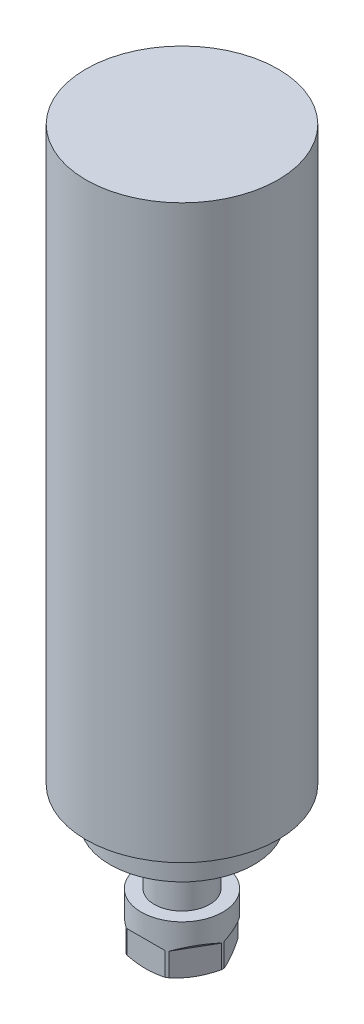
ISO-10303-21;
HEADER;
FILE_DESCRIPTION(('STEP AP214'),'2;1');
FILE_NAME('part.step','',(''),(''),'','','');
FILE_SCHEMA(('AUTOMOTIVE_DESIGN { 1 0 10303 214 1 1 1 1 }'));
ENDSEC;
DATA;
#1=APPLICATION_CONTEXT('core data for automotive mechanical design processes');
#2=APPLICATION_PROTOCOL_DEFINITION('international standard','automotive_design',2000,#1);
#3=PRODUCT_CONTEXT('',#1,'mechanical');
#4=PRODUCT('Part','Part','',(#3));
#5=PRODUCT_RELATED_PRODUCT_CATEGORY('part','',(#4));
#6=PRODUCT_DEFINITION_FORMATION('','',#4);
#7=PRODUCT_DEFINITION_CONTEXT('part definition',#1,'design');
#8=PRODUCT_DEFINITION('design','',#6,#7);
#9=PRODUCT_DEFINITION_SHAPE('','',#8);
#10=(LENGTH_UNIT() NAMED_UNIT(*) SI_UNIT(.MILLI.,.METRE.));
#11=(NAMED_UNIT(*) PLANE_ANGLE_UNIT() SI_UNIT($,.RADIAN.));
#12=(NAMED_UNIT(*) SI_UNIT($,.STERADIAN.) SOLID_ANGLE_UNIT());
#13=UNCERTAINTY_MEASURE_WITH_UNIT(LENGTH_MEASURE(1.E-05),#10,'distance_accuracy_value','');
#14=(GEOMETRIC_REPRESENTATION_CONTEXT(3) GLOBAL_UNCERTAINTY_ASSIGNED_CONTEXT((#13)) GLOBAL_UNIT_ASSIGNED_CONTEXT((#10,
#11,#12)) REPRESENTATION_CONTEXT('',''));
#15=CARTESIAN_POINT('',(0.,0.,0.));
#16=DIRECTION('',(0.,0.,1.));
#17=DIRECTION('',(1.,0.,0.));
#18=AXIS2_PLACEMENT_3D('',#15,#16,#17);
#19=CARTESIAN_POINT('',(0.,-109.7,39.9));
#20=DIRECTION('',(0.,-1.,0.));
#21=DIRECTION('',(0.,0.,-1.));
#22=AXIS2_PLACEMENT_3D('',#19,#20,#21);
#23=PLANE('',#22);
#24=CARTESIAN_POINT('',(0.,-109.7,0.));
#25=DIRECTION('',(0.,1.,0.));
#26=DIRECTION('',(0.,0.,1.));
#27=AXIS2_PLACEMENT_3D('',#24,#25,#26);
#28=CIRCLE('',#27,30.);
#29=CARTESIAN_POINT('',(0.,-109.7,30.));
#30=VERTEX_POINT('',#29);
#31=EDGE_CURVE('E202',#30,#30,#28,.T.);
#32=ORIENTED_EDGE('',*,*,#31,.T.);
#33=EDGE_LOOP('',(#32));
#34=FACE_BOUND('',#33,.T.);
#35=CARTESIAN_POINT('',(0.,-109.7,0.));
#36=DIRECTION('',(0.,-1.,0.));
#37=DIRECTION('',(0.,0.,-1.));
#38=AXIS2_PLACEMENT_3D('',#35,#36,#37);
#39=CIRCLE('',#38,40.);
#40=CARTESIAN_POINT('',(0.,-109.7,-40.0000000000001));
#41=VERTEX_POINT('',#40);
#42=EDGE_CURVE('E294',#41,#41,#39,.F.);
#43=ORIENTED_EDGE('',*,*,#42,.F.);
#44=EDGE_LOOP('',(#43));
#45=FACE_BOUND('',#44,.T.);
#46=ADVANCED_FACE('F41',(#34,#45),#23,.T.);
#47=CARTESIAN_POINT('',(0.,128.3,0.));
#48=DIRECTION('',(0.,1.,0.));
#49=DIRECTION('',(0.,0.,1.));
#50=AXIS2_PLACEMENT_3D('',#47,#48,#49);
#51=CYLINDRICAL_SURFACE('',#50,30.);
#52=CARTESIAN_POINT('',(0.,-123.7,0.));
#53=DIRECTION('',(0.,1.,0.));
#54=DIRECTION('',(0.,0.,1.));
#55=AXIS2_PLACEMENT_3D('',#52,#53,#54);
#56=CIRCLE('',#55,30.);
#57=CARTESIAN_POINT('',(0.,-123.7,30.));
#58=VERTEX_POINT('',#57);
#59=EDGE_CURVE('E199',#58,#58,#56,.T.);
#60=ORIENTED_EDGE('',*,*,#59,.T.);
#61=EDGE_LOOP('',(#60));
#62=FACE_BOUND('',#61,.T.);
#63=ORIENTED_EDGE('',*,*,#31,.F.);
#64=EDGE_LOOP('',(#63));
#65=FACE_BOUND('',#64,.T.);
#66=ADVANCED_FACE('F262',(#62,#65),#51,.T.);
#67=CARTESIAN_POINT('',(0.,-123.7,30.));
#68=DIRECTION('',(0.,-1.,0.));
#69=DIRECTION('',(0.,0.,-1.));
#70=AXIS2_PLACEMENT_3D('',#67,#68,#69);
#71=PLANE('',#70);
#72=CARTESIAN_POINT('',(0.,-123.7,0.));
#73=DIRECTION('',(0.,1.,0.));
#74=DIRECTION('',(0.,0.,1.));
#75=AXIS2_PLACEMENT_3D('',#72,#73,#74);
#76=CIRCLE('',#75,24.1);
#77=CARTESIAN_POINT('',(0.,-123.7,24.1));
#78=VERTEX_POINT('',#77);
#79=EDGE_CURVE('E194',#78,#78,#76,.T.);
#80=ORIENTED_EDGE('',*,*,#79,.T.);
#81=EDGE_LOOP('',(#80));
#82=FACE_BOUND('',#81,.T.);
#83=ORIENTED_EDGE('',*,*,#59,.F.);
#84=EDGE_LOOP('',(#83));
#85=FACE_BOUND('',#84,.T.);
#86=ADVANCED_FACE('F258',(#82,#85),#71,.T.);
#87=CARTESIAN_POINT('',(0.,128.3,0.));
#88=DIRECTION('',(0.,1.,0.));
#89=DIRECTION('',(0.,0.,1.));
#90=AXIS2_PLACEMENT_3D('',#87,#88,#89);
#91=CYLINDRICAL_SURFACE('',#90,24.1);
#92=CARTESIAN_POINT('',(0.,-126.8,0.));
#93=DIRECTION('',(0.,-1.,0.));
#94=DIRECTION('',(0.,0.,-1.));
#95=AXIS2_PLACEMENT_3D('',#92,#93,#94);
#96=CIRCLE('',#95,24.1);
#97=CARTESIAN_POINT('',(0.,-126.8,-24.1));
#98=VERTEX_POINT('',#97);
#99=EDGE_CURVE('E205',#98,#98,#96,.F.);
#100=ORIENTED_EDGE('',*,*,#99,.T.);
#101=EDGE_LOOP('',(#100));
#102=FACE_BOUND('',#101,.T.);
#103=ORIENTED_EDGE('',*,*,#79,.F.);
#104=EDGE_LOOP('',(#103));
#105=FACE_BOUND('',#104,.T.);
#106=ADVANCED_FACE('F254',(#102,#105),#91,.T.);
#107=CARTESIAN_POINT('',(0.,-128.3,24.1));
#108=DIRECTION('',(0.,-1.,0.));
#109=DIRECTION('',(0.,0.,-1.));
#110=AXIS2_PLACEMENT_3D('',#107,#108,#109);
#111=PLANE('',#110);
#112=CARTESIAN_POINT('',(0.,-128.3,0.));
#113=DIRECTION('',(0.,-1.,0.));
#114=DIRECTION('',(0.,0.,-1.));
#115=AXIS2_PLACEMENT_3D('',#112,#113,#114);
#116=CIRCLE('',#115,11.5);
#117=CARTESIAN_POINT('',(0.,-128.3,-11.5));
#118=VERTEX_POINT('',#117);
#119=EDGE_CURVE('E190',#118,#118,#116,.T.);
#120=ORIENTED_EDGE('',*,*,#119,.F.);
#121=EDGE_LOOP('',(#120));
#122=FACE_BOUND('',#121,.T.);
#123=CARTESIAN_POINT('',(0.,-128.3,0.));
#124=DIRECTION('',(0.,-1.,0.));
#125=DIRECTION('',(0.,0.,-1.));
#126=AXIS2_PLACEMENT_3D('',#123,#124,#125);
#127=CIRCLE('',#126,17.0999999999997);
#128=CARTESIAN_POINT('',(0.,-128.3,-17.0999999999998));
#129=VERTEX_POINT('',#128);
#130=EDGE_CURVE('E208',#129,#129,#127,.T.);
#131=ORIENTED_EDGE('',*,*,#130,.T.);
#132=EDGE_LOOP('',(#131));
#133=FACE_BOUND('',#132,.T.);
#134=ADVANCED_FACE('F251',(#122,#133),#111,.T.);
#135=CARTESIAN_POINT('',(0.,-126.8,0.));
#136=DIRECTION('',(0.,1.,0.));
#137=DIRECTION('',(0.,0.,1.));
#138=AXIS2_PLACEMENT_3D('',#135,#136,#137);
#139=CONICAL_SURFACE('',#138,24.1,1.35970299357215);
#140=ORIENTED_EDGE('',*,*,#130,.F.);
#141=EDGE_LOOP('',(#140));
#142=FACE_BOUND('',#141,.T.);
#143=ORIENTED_EDGE('',*,*,#99,.F.);
#144=EDGE_LOOP('',(#143));
#145=FACE_BOUND('',#144,.T.);
#146=ADVANCED_FACE('F249',(#142,#145),#139,.T.);
#147=CARTESIAN_POINT('',(0.,-147.3,0.));
#148=DIRECTION('',(0.,1.,0.));
#149=DIRECTION('',(0.,0.,1.));
#150=AXIS2_PLACEMENT_3D('',#147,#148,#149);
#151=CYLINDRICAL_SURFACE('',#150,11.5);
#152=CARTESIAN_POINT('',(0.,-147.3,0.));
#153=DIRECTION('',(0.,-1.,0.));
#154=DIRECTION('',(0.,0.,-1.));
#155=AXIS2_PLACEMENT_3D('',#152,#153,#154);
#156=CIRCLE('',#155,11.5);
#157=CARTESIAN_POINT('',(0.,-147.3,-11.5));
#158=VERTEX_POINT('',#157);
#159=EDGE_CURVE('E191',#158,#158,#156,.T.);
#160=ORIENTED_EDGE('',*,*,#159,.F.);
#161=EDGE_LOOP('',(#160));
#162=FACE_BOUND('',#161,.T.);
#163=ORIENTED_EDGE('',*,*,#119,.T.);
#164=EDGE_LOOP('',(#163));
#165=FACE_BOUND('',#164,.T.);
#166=ADVANCED_FACE('F246',(#162,#165),#151,.T.);
#167=CARTESIAN_POINT('',(0.,-169.8,0.));
#168=DIRECTION('',(0.,1.,0.));
#169=DIRECTION('',(0.,0.,1.));
#170=AXIS2_PLACEMENT_3D('',#167,#168,#169);
#171=CYLINDRICAL_SURFACE('',#170,17.);
#172=CARTESIAN_POINT('',(0.,-167.8,0.));
#173=DIRECTION('',(0.,-1.,0.));
#174=DIRECTION('',(0.,0.,-1.));
#175=AXIS2_PLACEMENT_3D('',#172,#173,#174);
#176=CIRCLE('',#175,17.);
#177=CARTESIAN_POINT('',(-16.9903810567666,-167.8,-0.571796769724566));
#178=VERTEX_POINT('',#177);
#179=CARTESIAN_POINT('',(-16.9903810567666,-167.8,0.571796769724456));
#180=VERTEX_POINT('',#179);
#181=EDGE_CURVE('E312',#178,#180,#176,.F.);
#182=ORIENTED_EDGE('',*,*,#181,.T.);
#183=DIRECTION('',(0.,1.,0.));
#184=VECTOR('',#183,1.);
#185=CARTESIAN_POINT('',(-16.9903810567666,-169.8,0.571796769724445));
#186=LINE('',#185,#184);
#187=CARTESIAN_POINT('',(-16.9903810567666,-158.2,0.571796769724423));
#188=VERTEX_POINT('',#187);
#189=EDGE_CURVE('E57',#180,#188,#186,.T.);
#190=ORIENTED_EDGE('',*,*,#189,.T.);
#191=CARTESIAN_POINT('',(0.,-173.2,0.));
#192=DIRECTION('',(0.612372435695794,0.707106781186548,-0.353553390593272));
#193=DIRECTION('',(-0.612372435695796,0.707106781186547,0.353553390593273));
#194=AXIS2_PLACEMENT_3D('',#191,#192,#193);
#195=ELLIPSE('',#194,24.0416305603426,17.);
#196=CARTESIAN_POINT('',(-8.99038105676662,-158.2,14.4282032302755));
#197=VERTEX_POINT('',#196);
#198=EDGE_CURVE('E12',#188,#197,#195,.T.);
#199=ORIENTED_EDGE('',*,*,#198,.T.);
#200=DIRECTION('',(0.,1.,0.));
#201=VECTOR('',#200,1.);
#202=CARTESIAN_POINT('',(-8.9903810567666,-169.8,14.4282032302755));
#203=LINE('',#202,#201);
#204=CARTESIAN_POINT('',(-8.99038105676662,-167.8,14.4282032302755));
#205=VERTEX_POINT('',#204);
#206=EDGE_CURVE('E174',#197,#205,#203,.F.);
#207=ORIENTED_EDGE('',*,*,#206,.T.);
#208=CARTESIAN_POINT('',(-8.00000000000001,-167.8,15.));
#209=VERTEX_POINT('',#208);
#210=EDGE_CURVE('E214',#205,#209,#176,.F.);
#211=ORIENTED_EDGE('',*,*,#210,.T.);
#212=DIRECTION('',(0.,1.,0.));
#213=VECTOR('',#212,1.);
#214=CARTESIAN_POINT('',(-8.,-169.8,15.));
#215=LINE('',#214,#213);
#216=CARTESIAN_POINT('',(-8.00000000000001,-158.2,15.));
#217=VERTEX_POINT('',#216);
#218=EDGE_CURVE('E184',#209,#217,#215,.T.);
#219=ORIENTED_EDGE('',*,*,#218,.T.);
#220=CARTESIAN_POINT('',(0.,-173.2,0.));
#221=DIRECTION('',(0.,0.707106781186548,-0.707106781186547));
#222=DIRECTION('',(0.,0.707106781186547,0.707106781186548));
#223=AXIS2_PLACEMENT_3D('',#220,#221,#222);
#224=ELLIPSE('',#223,24.0416305603426,17.);
#225=CARTESIAN_POINT('',(8.00000000000001,-158.2,15.));
#226=VERTEX_POINT('',#225);
#227=EDGE_CURVE('E226',#217,#226,#224,.T.);
#228=ORIENTED_EDGE('',*,*,#227,.T.);
#229=DIRECTION('',(0.,1.,0.));
#230=VECTOR('',#229,1.);
#231=CARTESIAN_POINT('',(8.,-169.8,15.));
#232=LINE('',#231,#230);
#233=CARTESIAN_POINT('',(8.00000000000001,-167.8,15.));
#234=VERTEX_POINT('',#233);
#235=EDGE_CURVE('E181',#226,#234,#232,.F.);
#236=ORIENTED_EDGE('',*,*,#235,.T.);
#237=CARTESIAN_POINT('',(8.99038105676641,-167.8,14.4282032302756));
#238=VERTEX_POINT('',#237);
#239=EDGE_CURVE('E215',#234,#238,#176,.F.);
#240=ORIENTED_EDGE('',*,*,#239,.T.);
#241=DIRECTION('',(0.,1.,0.));
#242=VECTOR('',#241,1.);
#243=CARTESIAN_POINT('',(8.99038105676641,-169.8,14.4282032302756));
#244=LINE('',#243,#242);
#245=CARTESIAN_POINT('',(8.99038105676641,-158.2,14.4282032302756));
#246=VERTEX_POINT('',#245);
#247=EDGE_CURVE('E165',#238,#246,#244,.T.);
#248=ORIENTED_EDGE('',*,*,#247,.T.);
#249=CARTESIAN_POINT('',(0.,-173.2,0.));
#250=DIRECTION('',(-0.61237243569579,0.707106781186548,-0.35355339059328));
#251=DIRECTION('',(0.612372435695791,0.707106781186547,0.353553390593281));
#252=AXIS2_PLACEMENT_3D('',#249,#250,#251);
#253=ELLIPSE('',#252,24.0416305603426,17.);
#254=CARTESIAN_POINT('',(16.9903810567666,-158.2,0.571796769724693));
#255=VERTEX_POINT('',#254);
#256=EDGE_CURVE('E363',#246,#255,#253,.T.);
#257=ORIENTED_EDGE('',*,*,#256,.T.);
#258=DIRECTION('',(0.,1.,0.));
#259=VECTOR('',#258,1.);
#260=CARTESIAN_POINT('',(16.9903810567666,-169.8,0.57179676972469));
#261=LINE('',#260,#259);
#262=CARTESIAN_POINT('',(16.9903810567666,-167.8,0.57179676972469));
#263=VERTEX_POINT('',#262);
#264=EDGE_CURVE('E162',#255,#263,#261,.F.);
#265=ORIENTED_EDGE('',*,*,#264,.T.);
#266=CARTESIAN_POINT('',(16.9903810567666,-167.8,-0.571796769724331));
#267=VERTEX_POINT('',#266);
#268=EDGE_CURVE('E219',#263,#267,#176,.F.);
#269=ORIENTED_EDGE('',*,*,#268,.T.);
#270=DIRECTION('',(0.,1.,0.));
#271=VECTOR('',#270,1.);
#272=CARTESIAN_POINT('',(16.9903810567666,-169.8,-0.571796769724332));
#273=LINE('',#272,#271);
#274=CARTESIAN_POINT('',(16.9903810567666,-158.2,-0.571796769724325));
#275=VERTEX_POINT('',#274);
#276=EDGE_CURVE('E171',#267,#275,#273,.T.);
#277=ORIENTED_EDGE('',*,*,#276,.T.);
#278=CARTESIAN_POINT('',(0.,-173.2,0.));
#279=DIRECTION('',(-0.612372435695797,0.707106781186548,0.353553390593268));
#280=DIRECTION('',(0.612372435695799,0.707106781186547,-0.353553390593269));
#281=AXIS2_PLACEMENT_3D('',#278,#279,#280);
#282=ELLIPSE('',#281,24.0416305603426,17.);
#283=CARTESIAN_POINT('',(8.99038105676672,-158.2,-14.4282032302754));
#284=VERTEX_POINT('',#283);
#285=EDGE_CURVE('E50',#275,#284,#282,.T.);
#286=ORIENTED_EDGE('',*,*,#285,.T.);
#287=DIRECTION('',(0.,1.,0.));
#288=VECTOR('',#287,1.);
#289=CARTESIAN_POINT('',(8.99038105676671,-169.8,-14.4282032302754));
#290=LINE('',#289,#288);
#291=CARTESIAN_POINT('',(8.99038105676671,-167.8,-14.4282032302754));
#292=VERTEX_POINT('',#291);
#293=EDGE_CURVE('E168',#284,#292,#290,.F.);
#294=ORIENTED_EDGE('',*,*,#293,.T.);
#295=CARTESIAN_POINT('',(8.00000000000001,-167.8,-15.));
#296=VERTEX_POINT('',#295);
#297=EDGE_CURVE('E314',#292,#296,#176,.F.);
#298=ORIENTED_EDGE('',*,*,#297,.T.);
#299=DIRECTION('',(0.,1.,0.));
#300=VECTOR('',#299,1.);
#301=CARTESIAN_POINT('',(8.,-169.8,-15.));
#302=LINE('',#301,#300);
#303=CARTESIAN_POINT('',(8.00000000000001,-158.2,-15.));
#304=VERTEX_POINT('',#303);
#305=EDGE_CURVE('E155',#296,#304,#302,.T.);
#306=ORIENTED_EDGE('',*,*,#305,.T.);
#307=CARTESIAN_POINT('',(0.,-173.2,0.));
#308=DIRECTION('',(0.,0.707106781186548,0.707106781186547));
#309=DIRECTION('',(0.,0.707106781186547,-0.707106781186548));
#310=AXIS2_PLACEMENT_3D('',#307,#308,#309);
#311=ELLIPSE('',#310,24.0416305603426,17.);
#312=CARTESIAN_POINT('',(-8.00000000000001,-158.2,-15.));
#313=VERTEX_POINT('',#312);
#314=EDGE_CURVE('E138',#304,#313,#311,.T.);
#315=ORIENTED_EDGE('',*,*,#314,.T.);
#316=DIRECTION('',(0.,1.,0.));
#317=VECTOR('',#316,1.);
#318=CARTESIAN_POINT('',(-8.,-169.8,-15.));
#319=LINE('',#318,#317);
#320=CARTESIAN_POINT('',(-8.00000000000019,-167.8,-15.));
#321=VERTEX_POINT('',#320);
#322=EDGE_CURVE('E153',#313,#321,#319,.F.);
#323=ORIENTED_EDGE('',*,*,#322,.T.);
#324=CARTESIAN_POINT('',(-8.99038105676651,-167.8,-14.4282032302756));
#325=VERTEX_POINT('',#324);
#326=EDGE_CURVE('E152',#321,#325,#176,.F.);
#327=ORIENTED_EDGE('',*,*,#326,.T.);
#328=DIRECTION('',(0.,1.,0.));
#329=VECTOR('',#328,1.);
#330=CARTESIAN_POINT('',(-8.99038105676651,-169.8,-14.4282032302756));
#331=LINE('',#330,#329);
#332=CARTESIAN_POINT('',(-8.9903810567665,-158.2,-14.4282032302756));
#333=VERTEX_POINT('',#332);
#334=EDGE_CURVE('E65',#325,#333,#331,.T.);
#335=ORIENTED_EDGE('',*,*,#334,.T.);
#336=CARTESIAN_POINT('',(0.,-173.2,0.));
#337=DIRECTION('',(0.612372435695792,0.707106781186549,0.353553390593276));
#338=DIRECTION('',(-0.612372435695794,0.707106781186547,-0.353553390593277));
#339=AXIS2_PLACEMENT_3D('',#336,#337,#338);
#340=ELLIPSE('',#339,24.0416305603426,17.);
#341=CARTESIAN_POINT('',(-16.9903810567666,-158.2,-0.571796769724596));
#342=VERTEX_POINT('',#341);
#343=EDGE_CURVE('E133',#333,#342,#340,.T.);
#344=ORIENTED_EDGE('',*,*,#343,.T.);
#345=DIRECTION('',(0.,1.,0.));
#346=VECTOR('',#345,1.);
#347=CARTESIAN_POINT('',(-16.9903810567666,-169.8,-0.571796769724562));
#348=LINE('',#347,#346);
#349=EDGE_CURVE('E142',#342,#178,#348,.F.);
#350=ORIENTED_EDGE('',*,*,#349,.T.);
#351=EDGE_LOOP('',(#182,#190,#199,#207,#211,#219,#228,#236,#240,#248,#257,#265,#269,#277,#286,
#294,#298,#306,#315,#323,#327,#335,#344,#350));
#352=FACE_BOUND('',#351,.T.);
#353=CARTESIAN_POINT('',(0.,-147.3,0.));
#354=DIRECTION('',(0.,-1.,0.));
#355=DIRECTION('',(0.,0.,-1.));
#356=AXIS2_PLACEMENT_3D('',#353,#354,#355);
#357=CIRCLE('',#356,17.);
#358=CARTESIAN_POINT('',(0.,-147.3,-17.));
#359=VERTEX_POINT('',#358);
#360=EDGE_CURVE('E187',#359,#359,#357,.T.);
#361=ORIENTED_EDGE('',*,*,#360,.T.);
#362=EDGE_LOOP('',(#361));
#363=FACE_BOUND('',#362,.T.);
#364=ADVANCED_FACE('F148',(#352,#363),#171,.T.);
#365=CARTESIAN_POINT('',(0.,-169.8,0.));
#366=DIRECTION('',(0.,-1.,0.));
#367=DIRECTION('',(0.,0.,-1.));
#368=AXIS2_PLACEMENT_3D('',#365,#366,#367);
#369=PLANE('',#368);
#370=CARTESIAN_POINT('',(0.,-169.8,0.));
#371=DIRECTION('',(0.,-1.,0.));
#372=DIRECTION('',(0.,0.,-1.));
#373=AXIS2_PLACEMENT_3D('',#370,#371,#372);
#374=CIRCLE('',#373,13.);
#375=CARTESIAN_POINT('',(0.,-169.8,-13.));
#376=VERTEX_POINT('',#375);
#377=EDGE_CURVE('E211',#376,#376,#374,.T.);
#378=ORIENTED_EDGE('',*,*,#377,.T.);
#379=EDGE_LOOP('',(#378));
#380=FACE_BOUND('',#379,.T.);
#381=ADVANCED_FACE('F236',(#380),#369,.T.);
#382=CARTESIAN_POINT('',(0.,-147.3,0.));
#383=DIRECTION('',(0.,-1.,0.));
#384=DIRECTION('',(0.,0.,-1.));
#385=AXIS2_PLACEMENT_3D('',#382,#383,#384);
#386=PLANE('',#385);
#387=ORIENTED_EDGE('',*,*,#159,.T.);
#388=EDGE_LOOP('',(#387));
#389=FACE_BOUND('',#388,.T.);
#390=ORIENTED_EDGE('',*,*,#360,.F.);
#391=EDGE_LOOP('',(#390));
#392=FACE_BOUND('',#391,.T.);
#393=ADVANCED_FACE('F239',(#389,#392),#386,.F.);
#394=CARTESIAN_POINT('',(0.,-169.8,0.));
#395=DIRECTION('',(0.,1.,0.));
#396=DIRECTION('',(0.,0.,1.));
#397=AXIS2_PLACEMENT_3D('',#394,#395,#396);
#398=CONICAL_SURFACE('',#397,13.,1.1071487177941);
#399=CARTESIAN_POINT('',(-16.9908060391903,-167.7998,0.571060678574181));
#400=CARTESIAN_POINT('',(-16.7533665806231,-167.911550235364,0.982317884534244));
#401=CARTESIAN_POINT('',(-16.5150226522285,-168.015975419338,1.39514167818923));
#402=CARTESIAN_POINT('',(-16.0365337173668,-168.20796470127,2.22390882422936));
#403=CARTESIAN_POINT('',(-15.7963879215827,-168.295520900248,2.63985354375138));
#404=CARTESIAN_POINT('',(-15.3142847014043,-168.451530420646,3.47488081559299));
#405=CARTESIAN_POINT('',(-15.0723257081218,-168.519964589191,3.89396608530644));
#406=CARTESIAN_POINT('',(-14.5871662103576,-168.635520107073,4.73428698520858));
#407=CARTESIAN_POINT('',(-14.3439659135463,-168.682644910444,5.15552225570168));
#408=CARTESIAN_POINT('',(-13.8617491429807,-168.753239873057,5.99074620258306));
#409=CARTESIAN_POINT('',(-13.6227499787795,-168.777178403478,6.40470489794607));
#410=CARTESIAN_POINT('',(-13.1444357176677,-168.802220341825,7.23316950017648));
#411=CARTESIAN_POINT('',(-12.9051206041595,-168.803322498142,7.64767543579172));
#412=CARTESIAN_POINT('',(-12.4269560925053,-168.782657629666,8.47588066435315));
#413=CARTESIAN_POINT('',(-12.1881064691409,-168.760911134552,8.88958034738899));
#414=CARTESIAN_POINT('',(-11.7111927184912,-168.695361189838,9.71561919434261));
#415=CARTESIAN_POINT('',(-11.4731285202599,-168.651559790549,10.1279584811424));
#416=CARTESIAN_POINT('',(-11.0474916667164,-168.554600615073,10.8651831370534));
#417=CARTESIAN_POINT('',(-10.8596965388106,-168.505272701772,11.1904538400002));
#418=CARTESIAN_POINT('',(-10.484998943302,-168.394628132822,11.839449112895));
#419=CARTESIAN_POINT('',(-10.2980964496961,-168.333311828613,12.1631737278816));
#420=CARTESIAN_POINT('',(-9.92368256614168,-168.199146856088,12.8116775972571));
#421=CARTESIAN_POINT('',(-9.73617969380772,-168.126203823157,13.1364420987047));
#422=CARTESIAN_POINT('',(-9.3622555497562,-167.97026858023,13.7840977143786));
#423=CARTESIAN_POINT('',(-9.17583408326751,-167.887278242705,14.1069891659585));
#424=CARTESIAN_POINT('',(-8.98995607434279,-167.7998,14.4289393214259));
#425=B_SPLINE_CURVE_WITH_KNOTS('',3,(#399,#400,#401,#402,#403,#404,#405,#406,#407,#408,#409,
#410,#411,#412,#413,#414,#415,#416,#417,#418,#419,#420,#421,#422,#423,#424),.UNSPECIFIED.,.F.,
.F.,(4,2,2,2,2,2,2,2,2,2,2,2,4),(0.,1.46361741364015,2.92791851610364,4.39368106680077,
5.85920594679948,7.29446788292789,8.72980848226113,10.163860519598,11.5977792663315,
12.7340301815999,13.8702477927155,15.0162066508117,16.1619522696476),.UNSPECIFIED.);
#426=EDGE_CURVE('E139',#180,#205,#425,.T.);
#427=ORIENTED_EDGE('',*,*,#426,.F.);
#428=ORIENTED_EDGE('',*,*,#181,.F.);
#429=CARTESIAN_POINT('',(-8.98995607434261,-167.7998,-14.4289393214261));
#430=CARTESIAN_POINT('',(-9.22739553290983,-167.911550235364,-14.017682115466));
#431=CARTESIAN_POINT('',(-9.46573946130442,-168.015975419337,-13.604858321811));
#432=CARTESIAN_POINT('',(-9.94422839616622,-168.20796470127,-12.7760911757709));
#433=CARTESIAN_POINT('',(-10.1843741919503,-168.295520900248,-12.3601464562489));
#434=CARTESIAN_POINT('',(-10.6664774121287,-168.451530420646,-11.5251191844072));
#435=CARTESIAN_POINT('',(-10.9084364054112,-168.519964589191,-11.1060339146938));
#436=CARTESIAN_POINT('',(-11.3935959031754,-168.635520107073,-10.2657130147916));
#437=CARTESIAN_POINT('',(-11.6367961999867,-168.682644910444,-9.84447774429854));
#438=CARTESIAN_POINT('',(-12.1190129705523,-168.753239873057,-9.00925379741715));
#439=CARTESIAN_POINT('',(-12.3580121347535,-168.777178403478,-8.59529510205414));
#440=CARTESIAN_POINT('',(-12.8363263958653,-168.802220341825,-7.76683049982373));
#441=CARTESIAN_POINT('',(-13.0756415093735,-168.803322498142,-7.35232456420848));
#442=CARTESIAN_POINT('',(-13.5538060210277,-168.782657629666,-6.52411933564704));
#443=CARTESIAN_POINT('',(-13.7926556443921,-168.760911134552,-6.1104196526112));
#444=CARTESIAN_POINT('',(-14.2695693950419,-168.695361189838,-5.28438080565757));
#445=CARTESIAN_POINT('',(-14.5076335932732,-168.651559790549,-4.87204151885783));
#446=CARTESIAN_POINT('',(-14.9332704468167,-168.554600615073,-4.13481686294677));
#447=CARTESIAN_POINT('',(-15.1210655747225,-168.505272701772,-3.80954616));
#448=CARTESIAN_POINT('',(-15.4957631702311,-168.394628132822,-3.16055088710517));
#449=CARTESIAN_POINT('',(-15.682665663837,-168.333311828613,-2.83682627211853));
#450=CARTESIAN_POINT('',(-16.0570795473914,-168.199146856088,-2.18832240274303));
#451=CARTESIAN_POINT('',(-16.2445824197254,-168.126203823157,-1.8635579012955));
#452=CARTESIAN_POINT('',(-16.6185065637769,-167.97026858023,-1.21590228562157));
#453=CARTESIAN_POINT('',(-16.8049280302656,-167.887278242705,-0.893010834041654));
#454=CARTESIAN_POINT('',(-16.9908060391903,-167.7998,-0.571060678574297));
#455=B_SPLINE_CURVE_WITH_KNOTS('',3,(#429,#430,#431,#432,#433,#434,#435,#436,#437,#438,#439,
#440,#441,#442,#443,#444,#445,#446,#447,#448,#449,#450,#451,#452,#453,#454),.UNSPECIFIED.,.F.,
.F.,(4,2,2,2,2,2,2,2,2,2,2,2,4),(0.,1.46361741364017,2.92791851610367,4.39368106680083,
5.85920594679956,7.29446788292799,8.72980848226124,10.1638605195981,11.5977792663316,
12.7340301816001,13.8702477927156,15.0162066508119,16.1619522696478),.UNSPECIFIED.);
#456=EDGE_CURVE('E326',#325,#178,#455,.T.);
#457=ORIENTED_EDGE('',*,*,#456,.F.);
#458=ORIENTED_EDGE('',*,*,#326,.F.);
#459=CARTESIAN_POINT('',(-22.8193103338443,-162.646054378749,-15.));
#460=CARTESIAN_POINT('',(-22.4838343406651,-162.786218343357,-15.));
#461=CARTESIAN_POINT('',(-22.1480290992188,-162.925593848942,-15.));
#462=CARTESIAN_POINT('',(-21.475690578457,-163.202586613505,-15.));
#463=CARTESIAN_POINT('',(-21.1391572920431,-163.340203855249,-15.));
#464=CARTESIAN_POINT('',(-20.1282774879246,-163.750179980153,-15.));
#465=CARTESIAN_POINT('',(-19.4527440162355,-164.019624294047,-15.));
#466=CARTESIAN_POINT('',(-18.0951409432194,-164.549959242779,-15.));
#467=CARTESIAN_POINT('',(-17.4130559204331,-164.810810501194,-15.));
#468=CARTESIAN_POINT('',(-16.044363007784,-165.32032837208,-15.));
#469=CARTESIAN_POINT('',(-15.3577553070158,-165.568995490351,-15.));
#470=CARTESIAN_POINT('',(-13.9888837809777,-166.047527801657,-15.));
#471=CARTESIAN_POINT('',(-13.3066959310131,-166.277609227316,-15.));
#472=CARTESIAN_POINT('',(-11.9361221627364,-166.718820528309,-15.));
#473=CARTESIAN_POINT('',(-11.2477358377144,-166.929949149945,-15.));
#474=CARTESIAN_POINT('',(-9.86487079391498,-167.327871602154,-15.));
#475=CARTESIAN_POINT('',(-9.17040109570744,-167.514696521145,-15.));
#476=CARTESIAN_POINT('',(-7.77401128246343,-167.858049557458,-15.));
#477=CARTESIAN_POINT('',(-7.07209255993163,-168.014583235676,-15.));
#478=CARTESIAN_POINT('',(-5.91969485684383,-168.239700839245,-15.));
#479=CARTESIAN_POINT('',(-5.47140021881601,-168.319486920479,-15.));
#480=CARTESIAN_POINT('',(-4.57212252235748,-168.462229757291,-15.));
#481=CARTESIAN_POINT('',(-4.12113952983604,-168.525186923735,-15.));
#482=CARTESIAN_POINT('',(-3.2171139584668,-168.632582309958,-15.));
#483=CARTESIAN_POINT('',(-2.76407214576915,-168.6770269262,-15.));
#484=CARTESIAN_POINT('',(-1.85646896834235,-168.746104159346,-15.));
#485=CARTESIAN_POINT('',(-1.40190761555763,-168.770736931616,-15.));
#486=CARTESIAN_POINT('',(-0.490246382339681,-168.799457318704,-15.));
#487=CARTESIAN_POINT('',(-0.0331437802426997,-168.803459507922,-15.));
#488=CARTESIAN_POINT('',(0.880769947663678,-168.790554435515,-15.));
#489=CARTESIAN_POINT('',(1.33758106851165,-168.773646827,-15.));
#490=CARTESIAN_POINT('',(2.24993697261499,-168.719481510577,-15.));
#491=CARTESIAN_POINT('',(2.70548188373455,-168.682225938488,-15.));
#492=CARTESIAN_POINT('',(3.61454262338952,-168.588531502087,-15.));
#493=CARTESIAN_POINT('',(4.0680585596581,-168.53209366885,-15.));
#494=CARTESIAN_POINT('',(5.18683052150172,-168.370685241679,-15.));
#495=CARTESIAN_POINT('',(5.85060300852951,-168.255389304405,-15.));
#496=CARTESIAN_POINT('',(7.17176985871206,-167.992376943646,-15.));
#497=CARTESIAN_POINT('',(7.82916224284743,-167.844650776499,-15.));
#498=CARTESIAN_POINT('',(9.13817603477505,-167.522455043079,-15.));
#499=CARTESIAN_POINT('',(9.78978907921132,-167.34795184345,-15.));
#500=CARTESIAN_POINT('',(11.0867878158223,-166.977534053193,-15.));
#501=CARTESIAN_POINT('',(11.7321739993672,-166.781621167322,-15.));
#502=CARTESIAN_POINT('',(13.0222628807681,-166.371128821976,-15.));
#503=CARTESIAN_POINT('',(13.6669243938555,-166.156420754752,-15.));
#504=CARTESIAN_POINT('',(14.9514348187061,-165.713103587298,-15.));
#505=CARTESIAN_POINT('',(15.5912836669223,-165.484494303876,-15.));
#506=CARTESIAN_POINT('',(16.8664609804802,-165.01626822381,-15.));
#507=CARTESIAN_POINT('',(17.501792076871,-164.776658565874,-15.));
#508=CARTESIAN_POINT('',(18.7689679203809,-164.288431030767,-15.));
#509=CARTESIAN_POINT('',(19.4008126943955,-164.039813223201,-15.));
#510=CARTESIAN_POINT('',(20.6675427472857,-163.532836259194,-15.));
#511=CARTESIAN_POINT('',(21.3023999137578,-163.274407012696,-15.));
#512=CARTESIAN_POINT('',(22.5695742016003,-162.751403852081,-15.));
#513=CARTESIAN_POINT('',(23.2018913212898,-162.486829933899,-15.));
#514=CARTESIAN_POINT('',(24.4644708480871,-161.952550034071,-15.));
#515=CARTESIAN_POINT('',(25.0947329078053,-161.682843232595,-15.));
#516=CARTESIAN_POINT('',(26.3534203854933,-161.139176323415,-15.));
#517=CARTESIAN_POINT('',(26.9818457974415,-160.865216201785,-15.));
#518=CARTESIAN_POINT('',(28.2265240649144,-160.31837058608,-15.));
#519=CARTESIAN_POINT('',(28.8428032877995,-160.045545053961,-15.));
#520=CARTESIAN_POINT('',(30.0740487762881,-159.496946505665,-15.));
#521=CARTESIAN_POINT('',(30.6890150398521,-159.221173484912,-15.));
#522=CARTESIAN_POINT('',(31.9176378358707,-158.667182271563,-15.));
#523=CARTESIAN_POINT('',(32.5312946860391,-158.388964783088,-15.));
#524=CARTESIAN_POINT('',(33.7576078011373,-157.830344620987,-15.));
#525=CARTESIAN_POINT('',(34.3702640733439,-157.549941963338,-15.));
#526=CARTESIAN_POINT('',(34.9824930311233,-157.268612644682,-15.));
#527=B_SPLINE_CURVE_WITH_KNOTS('',3,(#459,#460,#461,#462,#463,#464,#465,#466,#467,#468,#469,
#470,#471,#472,#473,#474,#475,#476,#477,#478,#479,#480,#481,#482,#483,#484,#485,#486,#487,#488,
#489,#490,#491,#492,#493,#494,#495,#496,#497,#498,#499,#500,#501,#502,#503,#504,#505,#506,#507,
#508,#509,#510,#511,#512,#513,#514,#515,#516,#517,#518,#519,#520,#521,#522,#523,#524,#525,#526),
.UNSPECIFIED.,.F.,.F.,(4,2,2,2,2,2,2,2,2,2,2,2,2,2,2,2,2,2,2,2,2,2,2,2,2,2,2,2,2,2,2,2,2,4),(0.,
1.09073671876652,2.18148412072817,4.36328138650852,6.55397878922322,8.74458517233109,
10.9041992913356,13.0639561602091,15.2209225961553,17.3774926776332,18.7432397937062,
20.1089535629107,21.4741950580881,22.8394258468202,24.2103051676523,25.5812072314803,
26.9519654266265,28.3226499531694,30.3427510695729,32.3634599579255,34.3867280584429,
36.4098351723889,38.4480678229826,40.4863273396219,42.5232823227894,44.5602215696855,
46.616505650584,48.6727910919726,50.7294077687891,52.7860311808568,54.8079284740364,
56.8298289058058,58.8511648749494,60.8724860780172),.UNSPECIFIED.);
#528=EDGE_CURVE('E327',#296,#321,#527,.F.);
#529=ORIENTED_EDGE('',*,*,#528,.F.);
#530=ORIENTED_EDGE('',*,*,#297,.F.);
#531=CARTESIAN_POINT('',(16.9908060391903,-167.7998,-0.571060678574066));
#532=CARTESIAN_POINT('',(16.7533665806231,-167.911550235364,-0.982317884534134));
#533=CARTESIAN_POINT('',(16.5150226522285,-168.015975419338,-1.39514167818912));
#534=CARTESIAN_POINT('',(16.0365337173668,-168.20796470127,-2.22390882422926));
#535=CARTESIAN_POINT('',(15.7963879215827,-168.295520900248,-2.63985354375128));
#536=CARTESIAN_POINT('',(15.3142847014043,-168.451530420646,-3.47488081559288));
#537=CARTESIAN_POINT('',(15.0723257081218,-168.519964589191,-3.89396608530634));
#538=CARTESIAN_POINT('',(14.5871662103577,-168.635520107073,-4.73428698520849));
#539=CARTESIAN_POINT('',(14.3439659135463,-168.682644910444,-5.15552225570159));
#540=CARTESIAN_POINT('',(13.8617491429807,-168.753239873057,-5.99074620258297));
#541=CARTESIAN_POINT('',(13.6227499787795,-168.777178403478,-6.40470489794598));
#542=CARTESIAN_POINT('',(13.1444357176677,-168.802220341825,-7.23316950017639));
#543=CARTESIAN_POINT('',(12.9051206041596,-168.803322498142,-7.64767543579163));
#544=CARTESIAN_POINT('',(12.4269560925054,-168.782657629666,-8.47588066435307));
#545=CARTESIAN_POINT('',(12.188106469141,-168.760911134552,-8.88958034738891));
#546=CARTESIAN_POINT('',(11.7111927184912,-168.695361189838,-9.71561919434254));
#547=CARTESIAN_POINT('',(11.47312852026,-168.651559790549,-10.1279584811423));
#548=CARTESIAN_POINT('',(11.0474916667165,-168.554600615073,-10.8651831370534));
#549=CARTESIAN_POINT('',(10.8596965388107,-168.505272701772,-11.1904538400001));
#550=CARTESIAN_POINT('',(10.484998943302,-168.394628132822,-11.839449112895));
#551=CARTESIAN_POINT('',(10.2980964496962,-168.333311828613,-12.1631737278816));
#552=CARTESIAN_POINT('',(9.92368256614172,-168.199146856088,-12.8116775972572));
#553=CARTESIAN_POINT('',(9.73617969380775,-168.126203823157,-13.1364420987047));
#554=CARTESIAN_POINT('',(9.36225554975623,-167.97026858023,-13.7840977143787));
#555=CARTESIAN_POINT('',(9.17583408326754,-167.887278242705,-14.1069891659586));
#556=CARTESIAN_POINT('',(8.98995607434281,-167.7998,-14.428939321426));
#557=B_SPLINE_CURVE_WITH_KNOTS('',3,(#531,#532,#533,#534,#535,#536,#537,#538,#539,#540,#541,
#542,#543,#544,#545,#546,#547,#548,#549,#550,#551,#552,#553,#554,#555,#556),.UNSPECIFIED.,.F.,
.F.,(4,2,2,2,2,2,2,2,2,2,2,2,4),(0.,1.46361741364015,2.92791851610364,4.39368106680077,
5.85920594679949,7.2944678829279,8.72980848226114,10.163860519598,11.5977792663315,
12.7340301815999,13.8702477927156,15.0162066508118,16.1619522696478),.UNSPECIFIED.);
#558=EDGE_CURVE('E354',#267,#292,#557,.T.);
#559=ORIENTED_EDGE('',*,*,#558,.F.);
#560=ORIENTED_EDGE('',*,*,#268,.F.);
#561=CARTESIAN_POINT('',(8.98995607434259,-167.7998,14.428939321426));
#562=CARTESIAN_POINT('',(9.22739553290981,-167.911550235364,14.0176821154659));
#563=CARTESIAN_POINT('',(9.4657394613044,-168.015975419337,13.604858321811));
#564=CARTESIAN_POINT('',(9.9442283961662,-168.20796470127,12.7760911757708));
#565=CARTESIAN_POINT('',(10.1843741919503,-168.295520900248,12.3601464562488));
#566=CARTESIAN_POINT('',(10.6664774121287,-168.451530420646,11.5251191844072));
#567=CARTESIAN_POINT('',(10.9084364054112,-168.519964589191,11.1060339146938));
#568=CARTESIAN_POINT('',(11.3935959031754,-168.635520107073,10.2657130147916));
#569=CARTESIAN_POINT('',(11.6367961999867,-168.682644910444,9.84447774429851));
#570=CARTESIAN_POINT('',(12.1190129705523,-168.753239873057,9.00925379741714));
#571=CARTESIAN_POINT('',(12.3580121347535,-168.777178403478,8.59529510205413));
#572=CARTESIAN_POINT('',(12.8363263958653,-168.802220341825,7.76683049982373));
#573=CARTESIAN_POINT('',(13.0756415093735,-168.803322498142,7.35232456420849));
#574=CARTESIAN_POINT('',(13.5538060210277,-168.782657629666,6.52411933564706));
#575=CARTESIAN_POINT('',(13.7926556443921,-168.760911134552,6.11041965261122));
#576=CARTESIAN_POINT('',(14.2695693950419,-168.695361189838,5.2843808056576));
#577=CARTESIAN_POINT('',(14.5076335932732,-168.651559790549,4.87204151885786));
#578=CARTESIAN_POINT('',(14.9332704468167,-168.554600615073,4.13481686294682));
#579=CARTESIAN_POINT('',(15.1210655747225,-168.505272701772,3.80954616000005));
#580=CARTESIAN_POINT('',(15.4957631702311,-168.394628132822,3.16055088710524));
#581=CARTESIAN_POINT('',(15.682665663837,-168.333311828613,2.83682627211861));
#582=CARTESIAN_POINT('',(16.0570795473914,-168.199146856088,2.18832240274312));
#583=CARTESIAN_POINT('',(16.2445824197254,-168.126203823157,1.8635579012956));
#584=CARTESIAN_POINT('',(16.6185065637769,-167.97026858023,1.21590228562168));
#585=CARTESIAN_POINT('',(16.8049280302656,-167.887278242705,0.893010834041769));
#586=CARTESIAN_POINT('',(16.9908060391903,-167.7998,0.571060678574416));
#587=B_SPLINE_CURVE_WITH_KNOTS('',3,(#561,#562,#563,#564,#565,#566,#567,#568,#569,#570,#571,
#572,#573,#574,#575,#576,#577,#578,#579,#580,#581,#582,#583,#584,#585,#586),.UNSPECIFIED.,.F.,
.F.,(4,2,2,2,2,2,2,2,2,2,2,2,4),(0.,1.46361741364015,2.92791851610365,4.39368106680079,
5.85920594679951,7.29446788292793,8.72980848226117,10.163860519598,11.5977792663315,
12.7340301815999,13.8702477927155,15.0162066508117,16.1619522696476),.UNSPECIFIED.);
#588=EDGE_CURVE('E323',#238,#263,#587,.T.);
#589=ORIENTED_EDGE('',*,*,#588,.F.);
#590=ORIENTED_EDGE('',*,*,#239,.F.);
#591=CARTESIAN_POINT('',(-22.6721911496282,-162.707462971126,15.));
#592=CARTESIAN_POINT('',(-22.3374901461082,-162.847029228553,15.));
#593=CARTESIAN_POINT('',(-22.0024574125179,-162.985799520469,15.));
#594=CARTESIAN_POINT('',(-21.3316584344817,-163.261564955547,15.));
#595=CARTESIAN_POINT('',(-20.9958921827088,-163.398560080881,15.));
#596=CARTESIAN_POINT('',(-19.9873028949767,-163.806642238152,15.));
#597=CARTESIAN_POINT('',(-19.3132841368978,-164.074786396127,15.));
#598=CARTESIAN_POINT('',(-17.9586234162816,-164.602446784737,15.));
#599=CARTESIAN_POINT('',(-17.2779655472081,-164.861922284551,15.));
#600=CARTESIAN_POINT('',(-15.9120976030932,-165.368565584476,15.));
#601=CARTESIAN_POINT('',(-15.2268877215869,-165.615733904095,15.));
#602=CARTESIAN_POINT('',(-13.8607140181179,-166.091154022617,15.));
#603=CARTESIAN_POINT('',(-13.1798262091108,-166.319623131799,15.));
#604=CARTESIAN_POINT('',(-11.8118277813462,-166.757423907841,15.));
#605=CARTESIAN_POINT('',(-11.1247167515203,-166.966754300231,15.));
#606=CARTESIAN_POINT('',(-9.74442329439039,-167.360855286447,15.));
#607=CARTESIAN_POINT('',(-9.05125022477073,-167.545658378843,15.));
#608=CARTESIAN_POINT('',(-7.65747640803976,-167.884735149777,15.));
#609=CARTESIAN_POINT('',(-6.9568770690217,-168.039014510555,15.));
#610=CARTESIAN_POINT('',(-5.80691529020368,-168.260238570344,15.));
#611=CARTESIAN_POINT('',(-5.35971684865054,-168.338454873144,15.));
#612=CARTESIAN_POINT('',(-4.4626781556307,-168.478013807656,15.));
#613=CARTESIAN_POINT('',(-4.01283797087861,-168.53935686363,15.));
#614=CARTESIAN_POINT('',(-3.11115025568268,-168.643516230323,15.));
#615=CARTESIAN_POINT('',(-2.65930343467868,-168.686338632365,15.));
#616=CARTESIAN_POINT('',(-1.75415919130729,-168.752208169226,15.));
#617=CARTESIAN_POINT('',(-1.30086177874182,-168.775255437388,15.));
#618=CARTESIAN_POINT('',(-0.391879965643605,-168.80088544115,15.));
#619=CARTESIAN_POINT('',(0.0638067635572648,-168.803386513178,15.));
#620=CARTESIAN_POINT('',(0.974823135090246,-168.787626578425,15.));
#621=CARTESIAN_POINT('',(1.43015277225859,-168.769365276752,15.));
#622=CARTESIAN_POINT('',(2.33950632757682,-168.712679093158,15.));
#623=CARTESIAN_POINT('',(2.79353035142614,-168.674255892508,15.));
#624=CARTESIAN_POINT('',(3.69952567323454,-168.578433459141,15.));
#625=CARTESIAN_POINT('',(4.1514970569562,-168.521035026774,15.));
#626=CARTESIAN_POINT('',(5.24583657751601,-168.360536823898,15.));
#627=CARTESIAN_POINT('',(5.88688192066676,-168.248391681759,15.));
#628=CARTESIAN_POINT('',(7.16301579375863,-167.993889726752,15.));
#629=CARTESIAN_POINT('',(7.79810265376868,-167.851524693846,15.));
#630=CARTESIAN_POINT('',(9.06284178681484,-167.541707402702,15.));
#631=CARTESIAN_POINT('',(9.69248697308208,-167.374226492879,15.));
#632=CARTESIAN_POINT('',(10.9459392522675,-167.019012145879,15.));
#633=CARTESIAN_POINT('',(11.5697467603391,-166.831280160961,15.));
#634=CARTESIAN_POINT('',(12.8165037377159,-166.43811455663,15.));
#635=CARTESIAN_POINT('',(13.4394169834819,-166.232566775147,15.));
#636=CARTESIAN_POINT('',(14.6806687728167,-165.808133486403,15.));
#637=CARTESIAN_POINT('',(15.2990072602883,-165.589247815892,15.));
#638=CARTESIAN_POINT('',(16.5313925752326,-165.14082789547,15.));
#639=CARTESIAN_POINT('',(17.1454416728312,-164.91129986175,15.));
#640=CARTESIAN_POINT('',(18.3701811761036,-164.443488446666,15.));
#641=CARTESIAN_POINT('',(18.9808716055537,-164.205205127373,15.));
#642=CARTESIAN_POINT('',(20.2049521566719,-163.719256513814,15.));
#643=CARTESIAN_POINT('',(20.8183161276618,-163.471525488103,15.));
#644=CARTESIAN_POINT('',(22.0425711115946,-162.970035840332,15.));
#645=CARTESIAN_POINT('',(22.6534621230856,-162.716277214733,15.));
#646=CARTESIAN_POINT('',(23.8732229403721,-162.203710037415,15.));
#647=CARTESIAN_POINT('',(24.4820924412691,-161.944900761101,15.));
#648=CARTESIAN_POINT('',(25.6980273819643,-161.42307730458,15.));
#649=CARTESIAN_POINT('',(26.3050928156919,-161.160063110241,15.));
#650=CARTESIAN_POINT('',(27.5080214212079,-160.634696908822,15.));
#651=CARTESIAN_POINT('',(28.1039091093297,-160.372400986622,15.));
#652=CARTESIAN_POINT('',(29.2943833988253,-159.844872202423,15.));
#653=CARTESIAN_POINT('',(29.888969998075,-159.579639335633,15.));
#654=CARTESIAN_POINT('',(31.0768538439435,-159.046725015581,15.));
#655=CARTESIAN_POINT('',(31.6701513917824,-158.77904423327,15.));
#656=CARTESIAN_POINT('',(32.8557496920853,-158.241495713644,15.));
#657=CARTESIAN_POINT('',(33.44805045215,-157.971627993098,15.));
#658=CARTESIAN_POINT('',(34.0399242355164,-157.70083038171,15.));
#659=B_SPLINE_CURVE_WITH_KNOTS('',3,(#591,#592,#593,#594,#595,#596,#597,#598,#599,#600,#601,
#602,#603,#604,#605,#606,#607,#608,#609,#610,#611,#612,#613,#614,#615,#616,#617,#618,#619,#620,
#621,#622,#623,#624,#625,#626,#627,#628,#629,#630,#631,#632,#633,#634,#635,#636,#637,#638,#639,
#640,#641,#642,#643,#644,#645,#646,#647,#648,#649,#650,#651,#652,#653,#654,#655,#656,#657,#658),
.UNSPECIFIED.,.F.,.F.,(4,2,2,2,2,2,2,2,2,2,2,2,2,2,2,2,2,2,2,2,2,2,2,2,2,2,2,2,2,2,2,2,2,4),(0.,
1.08790041897516,2.17581175473809,4.35194271728151,6.53716609592597,8.72229715389449,
10.8766677989708,13.0311818019715,15.1828119599719,17.3340411969087,18.6957290964684,
20.0573827545752,21.4185882323939,22.7797845316452,24.1463884808519,25.5130118404484,
26.8795212575078,28.2459730444314,30.197396060275,32.1493505597238,34.1035489834583,
36.0576073595187,38.0252728114535,39.9929623516706,41.959516699582,43.9260571081605,
45.9105272520487,47.894998560833,49.8797566969909,51.8645215043909,53.817697375519,
55.7708764329706,57.7235352967874,59.6761792030854),.UNSPECIFIED.);
#660=EDGE_CURVE('E218',#209,#234,#659,.T.);
#661=ORIENTED_EDGE('',*,*,#660,.F.);
#662=ORIENTED_EDGE('',*,*,#210,.F.);
#663=EDGE_LOOP('',(#427,#428,#457,#458,#529,#530,#559,#560,#589,#590,#661,#662));
#664=FACE_BOUND('',#663,.T.);
#665=ORIENTED_EDGE('',*,*,#377,.F.);
#666=EDGE_LOOP('',(#665));
#667=FACE_BOUND('',#666,.T.);
#668=ADVANCED_FACE('F43',(#664,#667),#398,.T.);
#669=CARTESIAN_POINT('',(-40.,-143.306726729926,29.8932732700737));
#670=DIRECTION('',(0.,0.707106781186548,-0.707106781186547));
#671=DIRECTION('',(0.,0.707106781186547,0.707106781186548));
#672=AXIS2_PLACEMENT_3D('',#669,#670,#671);
#673=PLANE('',#672);
#674=DIRECTION('',(1.,0.,0.));
#675=VECTOR('',#674,1.);
#676=CARTESIAN_POINT('',(-40.,-158.2,15.));
#677=LINE('',#676,#675);
#678=EDGE_CURVE('E178',#217,#226,#677,.T.);
#679=ORIENTED_EDGE('',*,*,#678,.T.);
#680=ORIENTED_EDGE('',*,*,#227,.F.);
#681=EDGE_LOOP('',(#679,#680));
#682=FACE_BOUND('',#681,.T.);
#683=ADVANCED_FACE('F233',(#682),#673,.F.);
#684=CARTESIAN_POINT('',(-40.,-158.2,15.));
#685=DIRECTION('',(0.,0.,-1.));
#686=DIRECTION('',(0.,1.,0.));
#687=AXIS2_PLACEMENT_3D('',#684,#685,#686);
#688=PLANE('',#687);
#689=ORIENTED_EDGE('',*,*,#660,.T.);
#690=ORIENTED_EDGE('',*,*,#235,.F.);
#691=ORIENTED_EDGE('',*,*,#678,.F.);
#692=ORIENTED_EDGE('',*,*,#218,.F.);
#693=EDGE_LOOP('',(#689,#690,#691,#692));
#694=FACE_BOUND('',#693,.T.);
#695=ADVANCED_FACE('F228',(#694),#688,.F.);
#696=CARTESIAN_POINT('',(14.3301270189225,-158.2,-54.8205080756888));
#697=DIRECTION('',(0.866025403784436,0.,0.500000000000004));
#698=DIRECTION('',(0.500000000000004,0.,-0.866025403784436));
#699=AXIS2_PLACEMENT_3D('',#696,#697,#698);
#700=PLANE('',#699);
#701=ORIENTED_EDGE('',*,*,#456,.T.);
#702=ORIENTED_EDGE('',*,*,#349,.F.);
#703=DIRECTION('',(-0.500000000000004,0.,0.866025403784436));
#704=VECTOR('',#703,1.);
#705=CARTESIAN_POINT('',(14.3301270189225,-158.2,-54.8205080756888));
#706=LINE('',#705,#704);
#707=EDGE_CURVE('E135',#333,#342,#706,.T.);
#708=ORIENTED_EDGE('',*,*,#707,.F.);
#709=ORIENTED_EDGE('',*,*,#334,.F.);
#710=EDGE_LOOP('',(#701,#702,#708,#709));
#711=FACE_BOUND('',#710,.T.);
#712=ADVANCED_FACE('F141',(#711),#700,.F.);
#713=CARTESIAN_POINT('',(1.43217402153495,-143.306726729926,-62.2671447107258));
#714=DIRECTION('',(0.612372435695792,0.707106781186549,0.353553390593276));
#715=DIRECTION('',(-0.755928946018456,0.654653670707975,0.));
#716=AXIS2_PLACEMENT_3D('',#713,#714,#715);
#717=PLANE('',#716);
#718=ORIENTED_EDGE('',*,*,#707,.T.);
#719=ORIENTED_EDGE('',*,*,#343,.F.);
#720=EDGE_LOOP('',(#718,#719));
#721=FACE_BOUND('',#720,.T.);
#722=ADVANCED_FACE('F134',(#721),#717,.F.);
#723=CARTESIAN_POINT('',(40.,-158.2,-15.));
#724=DIRECTION('',(0.,0.,1.));
#725=DIRECTION('',(0.,-1.,0.));
#726=AXIS2_PLACEMENT_3D('',#723,#724,#725);
#727=PLANE('',#726);
#728=ORIENTED_EDGE('',*,*,#528,.T.);
#729=ORIENTED_EDGE('',*,*,#322,.F.);
#730=DIRECTION('',(-1.,0.,0.));
#731=VECTOR('',#730,1.);
#732=CARTESIAN_POINT('',(40.,-158.2,-15.));
#733=LINE('',#732,#731);
#734=EDGE_CURVE('E144',#304,#313,#733,.T.);
#735=ORIENTED_EDGE('',*,*,#734,.F.);
#736=ORIENTED_EDGE('',*,*,#305,.F.);
#737=EDGE_LOOP('',(#728,#729,#735,#736));
#738=FACE_BOUND('',#737,.T.);
#739=ADVANCED_FACE('F391',(#738),#727,.F.);
#740=CARTESIAN_POINT('',(40.,-143.306726729926,-29.8932732700737));
#741=DIRECTION('',(0.,0.707106781186548,0.707106781186547));
#742=DIRECTION('',(0.,-0.707106781186547,0.707106781186548));
#743=AXIS2_PLACEMENT_3D('',#740,#741,#742);
#744=PLANE('',#743);
#745=ORIENTED_EDGE('',*,*,#734,.T.);
#746=ORIENTED_EDGE('',*,*,#314,.F.);
#747=EDGE_LOOP('',(#745,#746));
#748=FACE_BOUND('',#747,.T.);
#749=ADVANCED_FACE('F385',(#748),#744,.F.);
#750=CARTESIAN_POINT('',(-14.3301270189229,-158.2,54.8205080756888));
#751=DIRECTION('',(-0.866025403784433,0.,-0.50000000000001));
#752=DIRECTION('',(-0.50000000000001,0.,0.866025403784433));
#753=AXIS2_PLACEMENT_3D('',#750,#751,#752);
#754=PLANE('',#753);
#755=ORIENTED_EDGE('',*,*,#588,.T.);
#756=ORIENTED_EDGE('',*,*,#264,.F.);
#757=DIRECTION('',(0.50000000000001,0.,-0.866025403784433));
#758=VECTOR('',#757,1.);
#759=CARTESIAN_POINT('',(-14.3301270189229,-158.2,54.8205080756888));
#760=LINE('',#759,#758);
#761=EDGE_CURVE('E295',#246,#255,#760,.T.);
#762=ORIENTED_EDGE('',*,*,#761,.F.);
#763=ORIENTED_EDGE('',*,*,#247,.F.);
#764=EDGE_LOOP('',(#755,#756,#762,#763));
#765=FACE_BOUND('',#764,.T.);
#766=ADVANCED_FACE('F379',(#765),#754,.F.);
#767=CARTESIAN_POINT('',(-1.43217402153542,-143.306726729926,62.2671447107258));
#768=DIRECTION('',(-0.61237243569579,0.707106781186548,-0.35355339059328));
#769=DIRECTION('',(-0.755928946018457,-0.654653670707974,0.));
#770=AXIS2_PLACEMENT_3D('',#767,#768,#769);
#771=PLANE('',#770);
#772=ORIENTED_EDGE('',*,*,#761,.T.);
#773=ORIENTED_EDGE('',*,*,#256,.F.);
#774=EDGE_LOOP('',(#772,#773));
#775=FACE_BOUND('',#774,.T.);
#776=ADVANCED_FACE('F384',(#775),#771,.F.);
#777=CARTESIAN_POINT('',(40.3108891324549,-158.2,39.820508075689));
#778=DIRECTION('',(-0.866025403784443,0.,0.499999999999992));
#779=DIRECTION('',(0.499999999999992,0.,0.866025403784443));
#780=AXIS2_PLACEMENT_3D('',#777,#778,#779);
#781=PLANE('',#780);
#782=ORIENTED_EDGE('',*,*,#558,.T.);
#783=ORIENTED_EDGE('',*,*,#293,.F.);
#784=DIRECTION('',(-0.499999999999992,0.,-0.866025403784443));
#785=VECTOR('',#784,1.);
#786=CARTESIAN_POINT('',(40.3108891324549,-158.2,39.820508075689));
#787=LINE('',#786,#785);
#788=EDGE_CURVE('E299',#275,#284,#787,.T.);
#789=ORIENTED_EDGE('',*,*,#788,.F.);
#790=ORIENTED_EDGE('',*,*,#276,.F.);
#791=EDGE_LOOP('',(#782,#783,#789,#790));
#792=FACE_BOUND('',#791,.T.);
#793=ADVANCED_FACE('F371',(#792),#781,.F.);
#794=CARTESIAN_POINT('',(53.2088421298426,-143.306726729926,32.3738714406523));
#795=DIRECTION('',(-0.612372435695797,0.707106781186548,0.353553390593268));
#796=DIRECTION('',(-0.755928946018453,-0.654653670707978,0.));
#797=AXIS2_PLACEMENT_3D('',#794,#795,#796);
#798=PLANE('',#797);
#799=ORIENTED_EDGE('',*,*,#788,.T.);
#800=ORIENTED_EDGE('',*,*,#285,.F.);
#801=EDGE_LOOP('',(#799,#800));
#802=FACE_BOUND('',#801,.T.);
#803=ADVANCED_FACE('F345',(#802),#798,.F.);
#804=CARTESIAN_POINT('',(-53.2088421298429,-143.306726729926,-32.3738714406521));
#805=DIRECTION('',(0.612372435695794,0.707106781186548,-0.353553390593272));
#806=DIRECTION('',(-0.755928946018455,0.654653670707977,0.));
#807=AXIS2_PLACEMENT_3D('',#804,#805,#806);
#808=PLANE('',#807);
#809=DIRECTION('',(0.499999999999998,0.,0.86602540378444));
#810=VECTOR('',#809,1.);
#811=CARTESIAN_POINT('',(-40.3108891324553,-158.2,-39.8205080756889));
#812=LINE('',#811,#810);
#813=EDGE_CURVE('E143',#188,#197,#812,.T.);
#814=ORIENTED_EDGE('',*,*,#813,.T.);
#815=ORIENTED_EDGE('',*,*,#198,.F.);
#816=EDGE_LOOP('',(#814,#815));
#817=FACE_BOUND('',#816,.T.);
#818=ADVANCED_FACE('F309',(#817),#808,.F.);
#819=CARTESIAN_POINT('',(-40.3108891324553,-158.2,-39.8205080756889));
#820=DIRECTION('',(0.86602540378444,0.,-0.499999999999998));
#821=DIRECTION('',(-0.499999999999998,0.,-0.86602540378444));
#822=AXIS2_PLACEMENT_3D('',#819,#820,#821);
#823=PLANE('',#822);
#824=ORIENTED_EDGE('',*,*,#426,.T.);
#825=ORIENTED_EDGE('',*,*,#206,.F.);
#826=ORIENTED_EDGE('',*,*,#813,.F.);
#827=ORIENTED_EDGE('',*,*,#189,.F.);
#828=EDGE_LOOP('',(#824,#825,#826,#827));
#829=FACE_BOUND('',#828,.T.);
#830=ADVANCED_FACE('F274',(#829),#823,.F.);
#831=CARTESIAN_POINT('',(0.,128.3,0.));
#832=DIRECTION('',(0.,1.,0.));
#833=DIRECTION('',(0.,0.,1.));
#834=AXIS2_PLACEMENT_3D('',#831,#832,#833);
#835=CYLINDRICAL_SURFACE('',#834,40.);
#836=ORIENTED_EDGE('',*,*,#42,.T.);
#837=EDGE_LOOP('',(#836));
#838=FACE_BOUND('',#837,.T.);
#839=CARTESIAN_POINT('',(0.,128.3,0.));
#840=DIRECTION('',(0.,1.,0.));
#841=DIRECTION('',(0.,0.,1.));
#842=AXIS2_PLACEMENT_3D('',#839,#840,#841);
#843=CIRCLE('',#842,40.);
#844=CARTESIAN_POINT('',(0.,128.3,40.));
#845=VERTEX_POINT('',#844);
#846=EDGE_CURVE('E296',#845,#845,#843,.T.);
#847=ORIENTED_EDGE('',*,*,#846,.F.);
#848=EDGE_LOOP('',(#847));
#849=FACE_BOUND('',#848,.T.);
#850=ADVANCED_FACE('F270',(#838,#849),#835,.T.);
#851=CARTESIAN_POINT('',(0.,128.3,0.));
#852=DIRECTION('',(0.,1.,0.));
#853=DIRECTION('',(0.,0.,1.));
#854=AXIS2_PLACEMENT_3D('',#851,#852,#853);
#855=PLANE('',#854);
#856=ORIENTED_EDGE('',*,*,#846,.T.);
#857=EDGE_LOOP('',(#856));
#858=FACE_BOUND('',#857,.T.);
#859=ADVANCED_FACE('F273',(#858),#855,.T.);
#860=CLOSED_SHELL('',(#46,#66,#86,#106,#134,#146,#166,#364,#381,#393,#668,#683,#695,#712,#722,
#739,#749,#766,#776,#793,#803,#818,#830,#850,#859));
#861=MANIFOLD_SOLID_BREP('B2',#860);
#862=ADVANCED_BREP_SHAPE_REPRESENTATION('',(#18,#861),#14);
#863=SHAPE_DEFINITION_REPRESENTATION(#9,#862);
ENDSEC;
END-ISO-10303-21;
